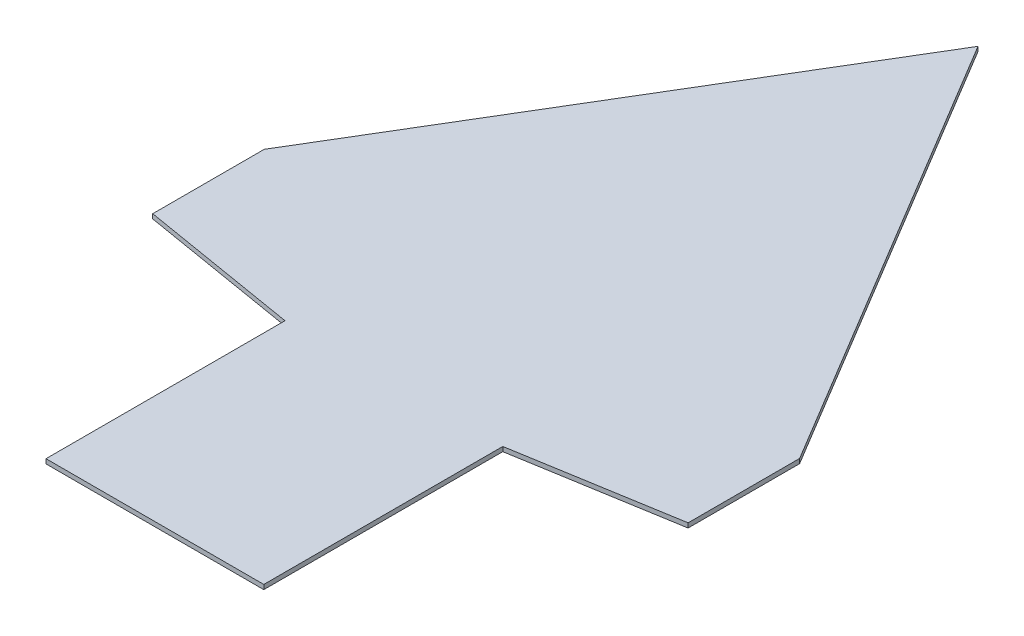
ISO-10303-21;
HEADER;
FILE_DESCRIPTION(('STEP AP214'),'2;1');
FILE_NAME('part.step','',(''),(''),'','','');
FILE_SCHEMA(('AUTOMOTIVE_DESIGN { 1 0 10303 214 1 1 1 1 }'));
ENDSEC;
DATA;
#1=APPLICATION_CONTEXT('core data for automotive mechanical design processes');
#2=APPLICATION_PROTOCOL_DEFINITION('international standard','automotive_design',2000,#1);
#3=PRODUCT_CONTEXT('',#1,'mechanical');
#4=PRODUCT('Part','Part','',(#3));
#5=PRODUCT_RELATED_PRODUCT_CATEGORY('part','',(#4));
#6=PRODUCT_DEFINITION_FORMATION('','',#4);
#7=PRODUCT_DEFINITION_CONTEXT('part definition',#1,'design');
#8=PRODUCT_DEFINITION('design','',#6,#7);
#9=PRODUCT_DEFINITION_SHAPE('','',#8);
#10=(LENGTH_UNIT() NAMED_UNIT(*) SI_UNIT(.MILLI.,.METRE.));
#11=(NAMED_UNIT(*) PLANE_ANGLE_UNIT() SI_UNIT($,.RADIAN.));
#12=(NAMED_UNIT(*) SI_UNIT($,.STERADIAN.) SOLID_ANGLE_UNIT());
#13=UNCERTAINTY_MEASURE_WITH_UNIT(LENGTH_MEASURE(1.E-05),#10,'distance_accuracy_value','');
#14=(GEOMETRIC_REPRESENTATION_CONTEXT(3) GLOBAL_UNCERTAINTY_ASSIGNED_CONTEXT((#13)) GLOBAL_UNIT_ASSIGNED_CONTEXT((#10,
#11,#12)) REPRESENTATION_CONTEXT('',''));
#15=CARTESIAN_POINT('',(0.,0.,0.));
#16=DIRECTION('',(0.,0.,1.));
#17=DIRECTION('',(1.,0.,0.));
#18=AXIS2_PLACEMENT_3D('',#15,#16,#17);
#19=CARTESIAN_POINT('',(45.6129627505325,2.54,273.071490489088));
#20=DIRECTION('',(0.164754096556276,0.,0.986334673256459));
#21=DIRECTION('',(0.986334673256459,0.,-0.164754096556276));
#22=AXIS2_PLACEMENT_3D('',#19,#20,#21);
#23=PLANE('',#22);
#24=DIRECTION('',(-0.986334673256459,0.,0.164754096556276));
#25=VECTOR('',#24,1.);
#26=CARTESIAN_POINT('',(45.6129627505325,0.,273.071490489088));
#27=LINE('',#26,#25);
#28=CARTESIAN_POINT('',(173.276970487061,0.,251.746914939145));
#29=VERTEX_POINT('',#28);
#30=CARTESIAN_POINT('',(84.3769704870607,0.,266.596478257746));
#31=VERTEX_POINT('',#30);
#32=EDGE_CURVE('E132',#29,#31,#27,.T.);
#33=ORIENTED_EDGE('',*,*,#32,.F.);
#34=DIRECTION('',(0.,-1.,0.));
#35=VECTOR('',#34,1.);
#36=CARTESIAN_POINT('',(173.276970487061,2.54,251.746914939145));
#37=LINE('',#36,#35);
#38=CARTESIAN_POINT('',(173.276970487061,2.54,251.746914939145));
#39=VERTEX_POINT('',#38);
#40=EDGE_CURVE('E11',#39,#29,#37,.T.);
#41=ORIENTED_EDGE('',*,*,#40,.F.);
#42=DIRECTION('',(-0.986334673256459,0.,0.164754096556276));
#43=VECTOR('',#42,1.);
#44=CARTESIAN_POINT('',(45.6129627505325,2.54,273.071490489088));
#45=LINE('',#44,#43);
#46=CARTESIAN_POINT('',(84.3769704870607,2.54,266.596478257746));
#47=VERTEX_POINT('',#46);
#48=EDGE_CURVE('E151',#39,#47,#45,.T.);
#49=ORIENTED_EDGE('',*,*,#48,.T.);
#50=DIRECTION('',(0.,-1.,0.));
#51=VECTOR('',#50,1.);
#52=CARTESIAN_POINT('',(84.3769704870607,2.54,266.596478257746));
#53=LINE('',#52,#51);
#54=EDGE_CURVE('E88',#47,#31,#53,.T.);
#55=ORIENTED_EDGE('',*,*,#54,.T.);
#56=EDGE_LOOP('',(#33,#41,#49,#55));
#57=FACE_BOUND('',#56,.T.);
#58=ADVANCED_FACE('F34',(#57),#23,.T.);
#59=CARTESIAN_POINT('',(173.276970487061,2.54,0.));
#60=DIRECTION('',(1.,0.,0.));
#61=DIRECTION('',(0.,0.,-1.));
#62=AXIS2_PLACEMENT_3D('',#59,#60,#61);
#63=PLANE('',#62);
#64=DIRECTION('',(0.,0.,1.));
#65=VECTOR('',#64,1.);
#66=CARTESIAN_POINT('',(173.276970487061,0.,0.));
#67=LINE('',#66,#65);
#68=CARTESIAN_POINT('',(173.276970487061,0.,189.321800239614));
#69=VERTEX_POINT('',#68);
#70=EDGE_CURVE('E135',#69,#29,#67,.T.);
#71=ORIENTED_EDGE('',*,*,#70,.F.);
#72=DIRECTION('',(0.,-1.,0.));
#73=VECTOR('',#72,1.);
#74=CARTESIAN_POINT('',(173.276970487061,2.54,189.321800239614));
#75=LINE('',#74,#73);
#76=CARTESIAN_POINT('',(173.276970487061,2.54,189.321800239614));
#77=VERTEX_POINT('',#76);
#78=EDGE_CURVE('E42',#77,#69,#75,.T.);
#79=ORIENTED_EDGE('',*,*,#78,.F.);
#80=DIRECTION('',(0.,0.,1.));
#81=VECTOR('',#80,1.);
#82=CARTESIAN_POINT('',(173.276970487061,2.54,0.));
#83=LINE('',#82,#81);
#84=EDGE_CURVE('E192',#77,#39,#83,.T.);
#85=ORIENTED_EDGE('',*,*,#84,.T.);
#86=ORIENTED_EDGE('',*,*,#40,.T.);
#87=EDGE_LOOP('',(#71,#79,#85,#86));
#88=FACE_BOUND('',#87,.T.);
#89=ADVANCED_FACE('F172',(#88),#63,.T.);
#90=CARTESIAN_POINT('',(43.8615076039312,2.54,-26.3227488613952));
#91=DIRECTION('',(0.857442517454998,0.,-0.514579759862779));
#92=DIRECTION('',(-0.514579759862779,0.,-0.857442517454998));
#93=AXIS2_PLACEMENT_3D('',#90,#91,#92);
#94=PLANE('',#93);
#95=DIRECTION('',(0.514579759862779,0.,0.857442517454998));
#96=VECTOR('',#95,1.);
#97=CARTESIAN_POINT('',(43.8615076039312,0.,-26.3227488613952));
#98=LINE('',#97,#96);
#99=CARTESIAN_POINT('',(23.4169704870608,0.,-60.3894120709357));
#100=VERTEX_POINT('',#99);
#101=EDGE_CURVE('E138',#100,#69,#98,.T.);
#102=ORIENTED_EDGE('',*,*,#101,.F.);
#103=DIRECTION('',(0.,-1.,0.));
#104=VECTOR('',#103,1.);
#105=CARTESIAN_POINT('',(23.4169704870608,2.54,-60.3894120709357));
#106=LINE('',#105,#104);
#107=CARTESIAN_POINT('',(23.4169704870608,2.54,-60.3894120709357));
#108=VERTEX_POINT('',#107);
#109=EDGE_CURVE('E161',#108,#100,#106,.T.);
#110=ORIENTED_EDGE('',*,*,#109,.F.);
#111=DIRECTION('',(0.514579759862779,0.,0.857442517454998));
#112=VECTOR('',#111,1.);
#113=CARTESIAN_POINT('',(43.8615076039312,2.54,-26.3227488613952));
#114=LINE('',#113,#112);
#115=EDGE_CURVE('E168',#108,#77,#114,.T.);
#116=ORIENTED_EDGE('',*,*,#115,.T.);
#117=ORIENTED_EDGE('',*,*,#78,.T.);
#118=EDGE_LOOP('',(#102,#110,#116,#117));
#119=FACE_BOUND('',#118,.T.);
#120=ADVANCED_FACE('F166',(#119),#94,.T.);
#121=CARTESIAN_POINT('',(-9.42883494879396,2.54,-5.65855730846823));
#122=DIRECTION('',(0.857442517454988,0.,0.514579759862795));
#123=DIRECTION('',(0.514579759862795,0.,-0.857442517454988));
#124=AXIS2_PLACEMENT_3D('',#121,#122,#123);
#125=PLANE('',#124);
#126=DIRECTION('',(-0.514579759862795,0.,0.857442517454988));
#127=VECTOR('',#126,1.);
#128=CARTESIAN_POINT('',(-9.42883494879396,0.,-5.65855730846823));
#129=LINE('',#128,#127);
#130=CARTESIAN_POINT('',(-126.443029512937,0.,189.321800239599));
#131=VERTEX_POINT('',#130);
#132=EDGE_CURVE('E141',#100,#131,#129,.T.);
#133=ORIENTED_EDGE('',*,*,#132,.T.);
#134=DIRECTION('',(0.,-1.,0.));
#135=VECTOR('',#134,1.);
#136=CARTESIAN_POINT('',(-126.443029512937,2.54,189.321800239599));
#137=LINE('',#136,#135);
#138=CARTESIAN_POINT('',(-126.443029512937,2.54,189.321800239599));
#139=VERTEX_POINT('',#138);
#140=EDGE_CURVE('E158',#139,#131,#137,.T.);
#141=ORIENTED_EDGE('',*,*,#140,.F.);
#142=DIRECTION('',(-0.514579759862795,0.,0.857442517454988));
#143=VECTOR('',#142,1.);
#144=CARTESIAN_POINT('',(-9.42883494879396,2.54,-5.65855730846823));
#145=LINE('',#144,#143);
#146=EDGE_CURVE('E187',#108,#139,#145,.T.);
#147=ORIENTED_EDGE('',*,*,#146,.F.);
#148=ORIENTED_EDGE('',*,*,#109,.T.);
#149=EDGE_LOOP('',(#133,#141,#147,#148));
#150=FACE_BOUND('',#149,.T.);
#151=ADVANCED_FACE('F180',(#150),#125,.F.);
#152=CARTESIAN_POINT('',(-126.443029512937,2.54,0.));
#153=DIRECTION('',(1.,0.,0.));
#154=DIRECTION('',(0.,0.,-1.));
#155=AXIS2_PLACEMENT_3D('',#152,#153,#154);
#156=PLANE('',#155);
#157=DIRECTION('',(0.,0.,1.));
#158=VECTOR('',#157,1.);
#159=CARTESIAN_POINT('',(-126.443029512937,0.,0.));
#160=LINE('',#159,#158);
#161=CARTESIAN_POINT('',(-126.443029512937,0.,251.746914939136));
#162=VERTEX_POINT('',#161);
#163=EDGE_CURVE('E143',#131,#162,#160,.T.);
#164=ORIENTED_EDGE('',*,*,#163,.T.);
#165=DIRECTION('',(0.,-1.,0.));
#166=VECTOR('',#165,1.);
#167=CARTESIAN_POINT('',(-126.443029512937,2.54,251.746914939136));
#168=LINE('',#167,#166);
#169=CARTESIAN_POINT('',(-126.443029512937,2.54,251.746914939136));
#170=VERTEX_POINT('',#169);
#171=EDGE_CURVE('E155',#170,#162,#168,.T.);
#172=ORIENTED_EDGE('',*,*,#171,.F.);
#173=DIRECTION('',(0.,0.,1.));
#174=VECTOR('',#173,1.);
#175=CARTESIAN_POINT('',(-126.443029512937,2.54,0.));
#176=LINE('',#175,#174);
#177=EDGE_CURVE('E186',#139,#170,#176,.T.);
#178=ORIENTED_EDGE('',*,*,#177,.F.);
#179=ORIENTED_EDGE('',*,*,#140,.T.);
#180=EDGE_LOOP('',(#164,#172,#178,#179));
#181=FACE_BOUND('',#180,.T.);
#182=ADVANCED_FACE('F184',(#181),#156,.F.);
#183=CARTESIAN_POINT('',(-44.3417063625921,2.54,265.460849659751));
#184=DIRECTION('',(0.164754096556376,0.,-0.986334673256442));
#185=DIRECTION('',(-0.986334673256442,0.,-0.164754096556376));
#186=AXIS2_PLACEMENT_3D('',#183,#184,#185);
#187=PLANE('',#186);
#188=DIRECTION('',(0.986334673256442,0.,0.164754096556376));
#189=VECTOR('',#188,1.);
#190=CARTESIAN_POINT('',(-44.3417063625921,0.,265.460849659751));
#191=LINE('',#190,#189);
#192=CARTESIAN_POINT('',(-37.5430295129392,0.,266.596478257746));
#193=VERTEX_POINT('',#192);
#194=EDGE_CURVE('E145',#162,#193,#191,.T.);
#195=ORIENTED_EDGE('',*,*,#194,.T.);
#196=DIRECTION('',(0.,-1.,0.));
#197=VECTOR('',#196,1.);
#198=CARTESIAN_POINT('',(-37.5430295129392,2.54,266.596478257746));
#199=LINE('',#198,#197);
#200=CARTESIAN_POINT('',(-37.5430295129392,2.54,266.596478257746));
#201=VERTEX_POINT('',#200);
#202=EDGE_CURVE('E124',#201,#193,#199,.T.);
#203=ORIENTED_EDGE('',*,*,#202,.F.);
#204=DIRECTION('',(0.986334673256442,0.,0.164754096556376));
#205=VECTOR('',#204,1.);
#206=CARTESIAN_POINT('',(-44.3417063625921,2.54,265.460849659751));
#207=LINE('',#206,#205);
#208=EDGE_CURVE('E115',#170,#201,#207,.T.);
#209=ORIENTED_EDGE('',*,*,#208,.F.);
#210=ORIENTED_EDGE('',*,*,#171,.T.);
#211=EDGE_LOOP('',(#195,#203,#209,#210));
#212=FACE_BOUND('',#211,.T.);
#213=ADVANCED_FACE('F207',(#212),#187,.F.);
#214=CARTESIAN_POINT('',(-37.5430295129392,2.54,0.));
#215=DIRECTION('',(1.,0.,0.));
#216=DIRECTION('',(0.,0.,-1.));
#217=AXIS2_PLACEMENT_3D('',#214,#215,#216);
#218=PLANE('',#217);
#219=DIRECTION('',(0.,0.,1.));
#220=VECTOR('',#219,1.);
#221=CARTESIAN_POINT('',(-37.5430295129392,0.,0.));
#222=LINE('',#221,#220);
#223=CARTESIAN_POINT('',(-37.5430295129392,0.,400.386363558214));
#224=VERTEX_POINT('',#223);
#225=EDGE_CURVE('E123',#193,#224,#222,.T.);
#226=ORIENTED_EDGE('',*,*,#225,.T.);
#227=DIRECTION('',(0.,-1.,0.));
#228=VECTOR('',#227,1.);
#229=CARTESIAN_POINT('',(-37.5430295129392,2.54,400.386363558214));
#230=LINE('',#229,#228);
#231=CARTESIAN_POINT('',(-37.5430295129392,2.54,400.386363558214));
#232=VERTEX_POINT('',#231);
#233=EDGE_CURVE('E120',#232,#224,#230,.T.);
#234=ORIENTED_EDGE('',*,*,#233,.F.);
#235=DIRECTION('',(0.,0.,1.));
#236=VECTOR('',#235,1.);
#237=CARTESIAN_POINT('',(-37.5430295129392,2.54,0.));
#238=LINE('',#237,#236);
#239=EDGE_CURVE('E109',#201,#232,#238,.T.);
#240=ORIENTED_EDGE('',*,*,#239,.F.);
#241=ORIENTED_EDGE('',*,*,#202,.T.);
#242=EDGE_LOOP('',(#226,#234,#240,#241));
#243=FACE_BOUND('',#242,.T.);
#244=ADVANCED_FACE('F121',(#243),#218,.F.);
#245=CARTESIAN_POINT('',(0.,2.54,400.386363558214));
#246=DIRECTION('',(0.,0.,-1.));
#247=DIRECTION('',(-1.,0.,0.));
#248=AXIS2_PLACEMENT_3D('',#245,#246,#247);
#249=PLANE('',#248);
#250=DIRECTION('',(1.,0.,0.));
#251=VECTOR('',#250,1.);
#252=CARTESIAN_POINT('',(0.,0.,400.386363558214));
#253=LINE('',#252,#251);
#254=CARTESIAN_POINT('',(84.3769704870607,0.,400.386363558214));
#255=VERTEX_POINT('',#254);
#256=EDGE_CURVE('E81',#224,#255,#253,.T.);
#257=ORIENTED_EDGE('',*,*,#256,.T.);
#258=DIRECTION('',(0.,-1.,0.));
#259=VECTOR('',#258,1.);
#260=CARTESIAN_POINT('',(84.3769704870607,2.54,400.386363558214));
#261=LINE('',#260,#259);
#262=CARTESIAN_POINT('',(84.3769704870607,2.54,400.386363558214));
#263=VERTEX_POINT('',#262);
#264=EDGE_CURVE('E125',#263,#255,#261,.T.);
#265=ORIENTED_EDGE('',*,*,#264,.F.);
#266=DIRECTION('',(1.,0.,0.));
#267=VECTOR('',#266,1.);
#268=CARTESIAN_POINT('',(0.,2.54,400.386363558214));
#269=LINE('',#268,#267);
#270=EDGE_CURVE('E113',#232,#263,#269,.T.);
#271=ORIENTED_EDGE('',*,*,#270,.F.);
#272=ORIENTED_EDGE('',*,*,#233,.T.);
#273=EDGE_LOOP('',(#257,#265,#271,#272));
#274=FACE_BOUND('',#273,.T.);
#275=ADVANCED_FACE('F127',(#274),#249,.F.);
#276=CARTESIAN_POINT('',(84.3769704870607,2.54,0.));
#277=DIRECTION('',(-1.,0.,0.));
#278=DIRECTION('',(0.,0.,1.));
#279=AXIS2_PLACEMENT_3D('',#276,#277,#278);
#280=PLANE('',#279);
#281=DIRECTION('',(0.,0.,-1.));
#282=VECTOR('',#281,1.);
#283=CARTESIAN_POINT('',(84.3769704870607,0.,0.));
#284=LINE('',#283,#282);
#285=EDGE_CURVE('E149',#255,#31,#284,.T.);
#286=ORIENTED_EDGE('',*,*,#285,.T.);
#287=ORIENTED_EDGE('',*,*,#54,.F.);
#288=DIRECTION('',(0.,0.,-1.));
#289=VECTOR('',#288,1.);
#290=CARTESIAN_POINT('',(84.3769704870607,2.54,0.));
#291=LINE('',#290,#289);
#292=EDGE_CURVE('E50',#263,#47,#291,.T.);
#293=ORIENTED_EDGE('',*,*,#292,.F.);
#294=ORIENTED_EDGE('',*,*,#264,.T.);
#295=EDGE_LOOP('',(#286,#287,#293,#294));
#296=FACE_BOUND('',#295,.T.);
#297=ADVANCED_FACE('F215',(#296),#280,.F.);
#298=CARTESIAN_POINT('',(0.,2.54,0.));
#299=DIRECTION('',(0.,1.,0.));
#300=DIRECTION('',(0.,0.,1.));
#301=AXIS2_PLACEMENT_3D('',#298,#299,#300);
#302=PLANE('',#301);
#303=ORIENTED_EDGE('',*,*,#48,.F.);
#304=ORIENTED_EDGE('',*,*,#84,.F.);
#305=ORIENTED_EDGE('',*,*,#115,.F.);
#306=ORIENTED_EDGE('',*,*,#146,.T.);
#307=ORIENTED_EDGE('',*,*,#177,.T.);
#308=ORIENTED_EDGE('',*,*,#208,.T.);
#309=ORIENTED_EDGE('',*,*,#239,.T.);
#310=ORIENTED_EDGE('',*,*,#270,.T.);
#311=ORIENTED_EDGE('',*,*,#292,.T.);
#312=EDGE_LOOP('',(#303,#304,#305,#306,#307,#308,#309,#310,#311));
#313=FACE_BOUND('',#312,.T.);
#314=ADVANCED_FACE('F111',(#313),#302,.T.);
#315=CARTESIAN_POINT('',(0.,0.,0.));
#316=DIRECTION('',(0.,1.,0.));
#317=DIRECTION('',(0.,0.,1.));
#318=AXIS2_PLACEMENT_3D('',#315,#316,#317);
#319=PLANE('',#318);
#320=ORIENTED_EDGE('',*,*,#32,.T.);
#321=ORIENTED_EDGE('',*,*,#285,.F.);
#322=ORIENTED_EDGE('',*,*,#256,.F.);
#323=ORIENTED_EDGE('',*,*,#225,.F.);
#324=ORIENTED_EDGE('',*,*,#194,.F.);
#325=ORIENTED_EDGE('',*,*,#163,.F.);
#326=ORIENTED_EDGE('',*,*,#132,.F.);
#327=ORIENTED_EDGE('',*,*,#101,.T.);
#328=ORIENTED_EDGE('',*,*,#70,.T.);
#329=EDGE_LOOP('',(#320,#321,#322,#323,#324,#325,#326,#327,#328));
#330=FACE_BOUND('',#329,.T.);
#331=ADVANCED_FACE('F175',(#330),#319,.F.);
#332=CLOSED_SHELL('',(#58,#89,#120,#151,#182,#213,#244,#275,#297,#314,#331));
#333=MANIFOLD_SOLID_BREP('B2',#332);
#334=ADVANCED_BREP_SHAPE_REPRESENTATION('',(#18,#333),#14);
#335=SHAPE_DEFINITION_REPRESENTATION(#9,#334);
ENDSEC;
END-ISO-10303-21;
